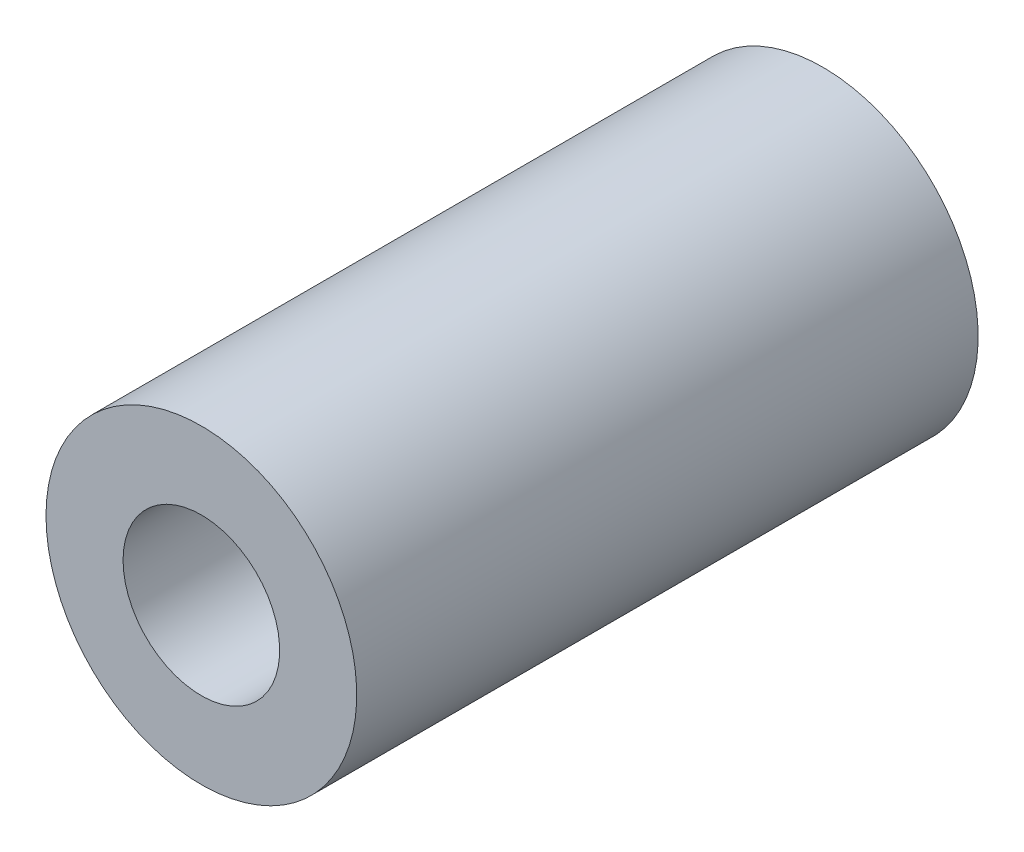
ISO-10303-21;
HEADER;
FILE_DESCRIPTION(('STEP AP214'),'2;1');
FILE_NAME('part.step','',(''),(''),'','','');
FILE_SCHEMA(('AUTOMOTIVE_DESIGN { 1 0 10303 214 1 1 1 1 }'));
ENDSEC;
DATA;
#1=APPLICATION_CONTEXT('core data for automotive mechanical design processes');
#2=APPLICATION_PROTOCOL_DEFINITION('international standard','automotive_design',2000,#1);
#3=PRODUCT_CONTEXT('',#1,'mechanical');
#4=PRODUCT('Part','Part','',(#3));
#5=PRODUCT_RELATED_PRODUCT_CATEGORY('part','',(#4));
#6=PRODUCT_DEFINITION_FORMATION('','',#4);
#7=PRODUCT_DEFINITION_CONTEXT('part definition',#1,'design');
#8=PRODUCT_DEFINITION('design','',#6,#7);
#9=PRODUCT_DEFINITION_SHAPE('','',#8);
#10=(LENGTH_UNIT() NAMED_UNIT(*) SI_UNIT(.MILLI.,.METRE.));
#11=(NAMED_UNIT(*) PLANE_ANGLE_UNIT() SI_UNIT($,.RADIAN.));
#12=(NAMED_UNIT(*) SI_UNIT($,.STERADIAN.) SOLID_ANGLE_UNIT());
#13=UNCERTAINTY_MEASURE_WITH_UNIT(LENGTH_MEASURE(1.E-05),#10,'distance_accuracy_value','');
#14=(GEOMETRIC_REPRESENTATION_CONTEXT(3) GLOBAL_UNCERTAINTY_ASSIGNED_CONTEXT((#13)) GLOBAL_UNIT_ASSIGNED_CONTEXT((#10,
#11,#12)) REPRESENTATION_CONTEXT('',''));
#15=CARTESIAN_POINT('',(0.,0.,0.));
#16=DIRECTION('',(0.,0.,1.));
#17=DIRECTION('',(1.,0.,0.));
#18=AXIS2_PLACEMENT_3D('',#15,#16,#17);
#19=CARTESIAN_POINT('',(0.,0.,12.7));
#20=DIRECTION('',(0.,0.,-1.));
#21=DIRECTION('',(-1.,0.,0.));
#22=AXIS2_PLACEMENT_3D('',#19,#20,#21);
#23=CYLINDRICAL_SURFACE('',#22,3.2004);
#24=CARTESIAN_POINT('',(0.,0.,-12.7));
#25=DIRECTION('',(0.,0.,-1.));
#26=DIRECTION('',(-1.,0.,0.));
#27=AXIS2_PLACEMENT_3D('',#24,#25,#26);
#28=CIRCLE('',#27,3.2004);
#29=CARTESIAN_POINT('',(-3.2004,0.,-12.7));
#30=VERTEX_POINT('',#29);
#31=EDGE_CURVE('E27',#30,#30,#28,.T.);
#32=ORIENTED_EDGE('',*,*,#31,.T.);
#33=EDGE_LOOP('',(#32));
#34=FACE_BOUND('',#33,.T.);
#35=CARTESIAN_POINT('',(0.,0.,12.7));
#36=DIRECTION('',(0.,0.,-1.));
#37=DIRECTION('',(-1.,0.,0.));
#38=AXIS2_PLACEMENT_3D('',#35,#36,#37);
#39=CIRCLE('',#38,3.2004);
#40=CARTESIAN_POINT('',(-3.2004,0.,12.7));
#41=VERTEX_POINT('',#40);
#42=EDGE_CURVE('E18',#41,#41,#39,.T.);
#43=ORIENTED_EDGE('',*,*,#42,.F.);
#44=EDGE_LOOP('',(#43));
#45=FACE_BOUND('',#44,.T.);
#46=ADVANCED_FACE('F15',(#34,#45),#23,.F.);
#47=CARTESIAN_POINT('',(0.,0.,12.7));
#48=DIRECTION('',(0.,0.,1.));
#49=DIRECTION('',(1.,0.,0.));
#50=AXIS2_PLACEMENT_3D('',#47,#48,#49);
#51=PLANE('',#50);
#52=ORIENTED_EDGE('',*,*,#42,.T.);
#53=EDGE_LOOP('',(#52));
#54=FACE_BOUND('',#53,.T.);
#55=CARTESIAN_POINT('',(0.,0.,12.7));
#56=DIRECTION('',(0.,0.,-1.));
#57=DIRECTION('',(-1.,0.,0.));
#58=AXIS2_PLACEMENT_3D('',#55,#56,#57);
#59=CIRCLE('',#58,6.35);
#60=CARTESIAN_POINT('',(-6.35,0.,12.7));
#61=VERTEX_POINT('',#60);
#62=EDGE_CURVE('E22',#61,#61,#59,.T.);
#63=ORIENTED_EDGE('',*,*,#62,.F.);
#64=EDGE_LOOP('',(#63));
#65=FACE_BOUND('',#64,.T.);
#66=ADVANCED_FACE('F35',(#54,#65),#51,.T.);
#67=CARTESIAN_POINT('',(0.,0.,-12.7));
#68=DIRECTION('',(0.,0.,1.));
#69=DIRECTION('',(1.,0.,0.));
#70=AXIS2_PLACEMENT_3D('',#67,#68,#69);
#71=PLANE('',#70);
#72=ORIENTED_EDGE('',*,*,#31,.F.);
#73=EDGE_LOOP('',(#72));
#74=FACE_BOUND('',#73,.T.);
#75=CARTESIAN_POINT('',(0.,0.,-12.7));
#76=DIRECTION('',(0.,0.,-1.));
#77=DIRECTION('',(-1.,0.,0.));
#78=AXIS2_PLACEMENT_3D('',#75,#76,#77);
#79=CIRCLE('',#78,6.35);
#80=CARTESIAN_POINT('',(-6.35,0.,-12.7));
#81=VERTEX_POINT('',#80);
#82=EDGE_CURVE('E10',#81,#81,#79,.F.);
#83=ORIENTED_EDGE('',*,*,#82,.F.);
#84=EDGE_LOOP('',(#83));
#85=FACE_BOUND('',#84,.T.);
#86=ADVANCED_FACE('F43',(#74,#85),#71,.F.);
#87=CARTESIAN_POINT('',(0.,0.,12.7));
#88=DIRECTION('',(0.,0.,-1.));
#89=DIRECTION('',(-1.,0.,0.));
#90=AXIS2_PLACEMENT_3D('',#87,#88,#89);
#91=CYLINDRICAL_SURFACE('',#90,6.35);
#92=ORIENTED_EDGE('',*,*,#82,.T.);
#93=EDGE_LOOP('',(#92));
#94=FACE_BOUND('',#93,.T.);
#95=ORIENTED_EDGE('',*,*,#62,.T.);
#96=EDGE_LOOP('',(#95));
#97=FACE_BOUND('',#96,.T.);
#98=ADVANCED_FACE('F44',(#94,#97),#91,.T.);
#99=CLOSED_SHELL('',(#46,#66,#86,#98));
#100=MANIFOLD_SOLID_BREP('B1',#99);
#101=ADVANCED_BREP_SHAPE_REPRESENTATION('',(#18,#100),#14);
#102=SHAPE_DEFINITION_REPRESENTATION(#9,#101);
ENDSEC;
END-ISO-10303-21;
